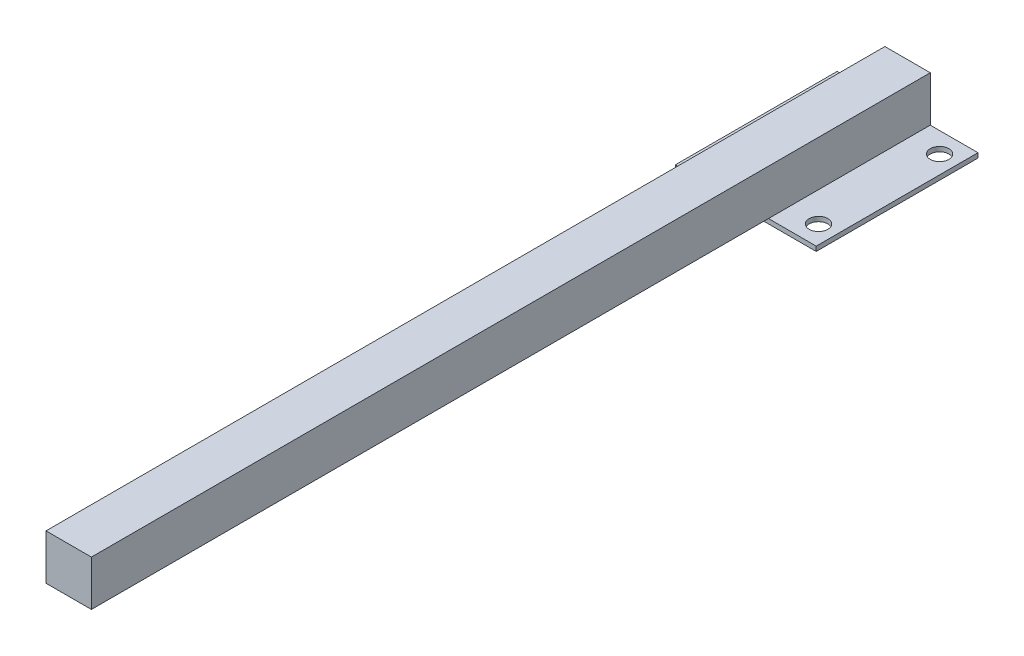
ISO-10303-21;
HEADER;
FILE_DESCRIPTION(('STEP AP214'),'2;1');
FILE_NAME('part.step','',(''),(''),'','','');
FILE_SCHEMA(('AUTOMOTIVE_DESIGN { 1 0 10303 214 1 1 1 1 }'));
ENDSEC;
DATA;
#1=APPLICATION_CONTEXT('core data for automotive mechanical design processes');
#2=APPLICATION_PROTOCOL_DEFINITION('international standard','automotive_design',2000,#1);
#3=PRODUCT_CONTEXT('',#1,'mechanical');
#4=PRODUCT('Part','Part','',(#3));
#5=PRODUCT_RELATED_PRODUCT_CATEGORY('part','',(#4));
#6=PRODUCT_DEFINITION_FORMATION('','',#4);
#7=PRODUCT_DEFINITION_CONTEXT('part definition',#1,'design');
#8=PRODUCT_DEFINITION('design','',#6,#7);
#9=PRODUCT_DEFINITION_SHAPE('','',#8);
#10=(LENGTH_UNIT() NAMED_UNIT(*) SI_UNIT(.MILLI.,.METRE.));
#11=(NAMED_UNIT(*) PLANE_ANGLE_UNIT() SI_UNIT($,.RADIAN.));
#12=(NAMED_UNIT(*) SI_UNIT($,.STERADIAN.) SOLID_ANGLE_UNIT());
#13=UNCERTAINTY_MEASURE_WITH_UNIT(LENGTH_MEASURE(1.E-05),#10,'distance_accuracy_value','');
#14=(GEOMETRIC_REPRESENTATION_CONTEXT(3) GLOBAL_UNCERTAINTY_ASSIGNED_CONTEXT((#13)) GLOBAL_UNIT_ASSIGNED_CONTEXT((#10,
#11,#12)) REPRESENTATION_CONTEXT('',''));
#15=CARTESIAN_POINT('',(0.,0.,0.));
#16=DIRECTION('',(0.,0.,1.));
#17=DIRECTION('',(1.,0.,0.));
#18=AXIS2_PLACEMENT_3D('',#15,#16,#17);
#19=CARTESIAN_POINT('',(0.,2.,0.));
#20=DIRECTION('',(0.,1.,0.));
#21=DIRECTION('',(0.,0.,1.));
#22=AXIS2_PLACEMENT_3D('',#19,#20,#21);
#23=PLANE('',#22);
#24=CARTESIAN_POINT('',(22.5,2.,26.));
#25=DIRECTION('',(0.,1.,0.));
#26=DIRECTION('',(0.,0.,1.));
#27=AXIS2_PLACEMENT_3D('',#24,#25,#26);
#28=CIRCLE('',#27,4.);
#29=CARTESIAN_POINT('',(22.5,2.,30.));
#30=VERTEX_POINT('',#29);
#31=EDGE_CURVE('E153',#30,#30,#28,.T.);
#32=ORIENTED_EDGE('',*,*,#31,.F.);
#33=EDGE_LOOP('',(#32));
#34=FACE_BOUND('',#33,.T.);
#35=CARTESIAN_POINT('',(22.5,2.,-26.));
#36=DIRECTION('',(0.,1.,0.));
#37=DIRECTION('',(0.,0.,-1.));
#38=AXIS2_PLACEMENT_3D('',#35,#36,#37);
#39=CIRCLE('',#38,4.);
#40=CARTESIAN_POINT('',(22.5,2.,-30.));
#41=VERTEX_POINT('',#40);
#42=EDGE_CURVE('E165',#41,#41,#39,.T.);
#43=ORIENTED_EDGE('',*,*,#42,.F.);
#44=EDGE_LOOP('',(#43));
#45=FACE_BOUND('',#44,.T.);
#46=DIRECTION('',(-1.,0.,0.));
#47=VECTOR('',#46,1.);
#48=CARTESIAN_POINT('',(-30.25,2.,-34.75));
#49=LINE('',#48,#47);
#50=CARTESIAN_POINT('',(30.25,2.,-34.75));
#51=VERTEX_POINT('',#50);
#52=CARTESIAN_POINT('',(9.75000000000001,2.,-34.75));
#53=VERTEX_POINT('',#52);
#54=EDGE_CURVE('E182',#51,#53,#49,.T.);
#55=ORIENTED_EDGE('',*,*,#54,.T.);
#56=DIRECTION('',(0.,0.,1.));
#57=VECTOR('',#56,1.);
#58=CARTESIAN_POINT('',(9.75,2.,-62.3271644662753));
#59=LINE('',#58,#57);
#60=CARTESIAN_POINT('',(9.75,2.,34.75));
#61=VERTEX_POINT('',#60);
#62=EDGE_CURVE('E56',#53,#61,#59,.T.);
#63=ORIENTED_EDGE('',*,*,#62,.T.);
#64=DIRECTION('',(1.,0.,0.));
#65=VECTOR('',#64,1.);
#66=CARTESIAN_POINT('',(-30.25,2.,34.75));
#67=LINE('',#66,#65);
#68=CARTESIAN_POINT('',(30.25,2.,34.75));
#69=VERTEX_POINT('',#68);
#70=EDGE_CURVE('E186',#61,#69,#67,.T.);
#71=ORIENTED_EDGE('',*,*,#70,.T.);
#72=DIRECTION('',(0.,0.,-1.));
#73=VECTOR('',#72,1.);
#74=CARTESIAN_POINT('',(30.25,2.,-34.75));
#75=LINE('',#74,#73);
#76=EDGE_CURVE('E177',#69,#51,#75,.T.);
#77=ORIENTED_EDGE('',*,*,#76,.T.);
#78=EDGE_LOOP('',(#55,#63,#71,#77));
#79=FACE_BOUND('',#78,.T.);
#80=ADVANCED_FACE('F41',(#34,#45,#79),#23,.T.);
#81=DIRECTION('',(0.,0.,1.));
#82=VECTOR('',#81,1.);
#83=CARTESIAN_POINT('',(-9.75,2.,-62.3271644662753));
#84=LINE('',#83,#82);
#85=CARTESIAN_POINT('',(-9.75,2.,-34.75));
#86=VERTEX_POINT('',#85);
#87=CARTESIAN_POINT('',(-9.75,2.,34.75));
#88=VERTEX_POINT('',#87);
#89=EDGE_CURVE('E64',#86,#88,#84,.T.);
#90=ORIENTED_EDGE('',*,*,#89,.F.);
#91=CARTESIAN_POINT('',(-30.25,2.,-34.75));
#92=VERTEX_POINT('',#91);
#93=EDGE_CURVE('E180',#86,#92,#49,.T.);
#94=ORIENTED_EDGE('',*,*,#93,.T.);
#95=DIRECTION('',(0.,0.,1.));
#96=VECTOR('',#95,1.);
#97=CARTESIAN_POINT('',(-30.25,2.,-34.75));
#98=LINE('',#97,#96);
#99=CARTESIAN_POINT('',(-30.25,2.,34.75));
#100=VERTEX_POINT('',#99);
#101=EDGE_CURVE('E184',#92,#100,#98,.T.);
#102=ORIENTED_EDGE('',*,*,#101,.T.);
#103=EDGE_CURVE('E187',#100,#88,#67,.T.);
#104=ORIENTED_EDGE('',*,*,#103,.T.);
#105=EDGE_LOOP('',(#90,#94,#102,#104));
#106=FACE_BOUND('',#105,.T.);
#107=CARTESIAN_POINT('',(-22.5,2.,26.));
#108=DIRECTION('',(0.,1.,0.));
#109=DIRECTION('',(0.,0.,-1.));
#110=AXIS2_PLACEMENT_3D('',#107,#108,#109);
#111=CIRCLE('',#110,4.);
#112=CARTESIAN_POINT('',(-22.5,2.,22.));
#113=VERTEX_POINT('',#112);
#114=EDGE_CURVE('E159',#113,#113,#111,.T.);
#115=ORIENTED_EDGE('',*,*,#114,.F.);
#116=EDGE_LOOP('',(#115));
#117=FACE_BOUND('',#116,.T.);
#118=CARTESIAN_POINT('',(-22.5,2.,-26.));
#119=DIRECTION('',(0.,1.,0.));
#120=DIRECTION('',(0.,0.,1.));
#121=AXIS2_PLACEMENT_3D('',#118,#119,#120);
#122=CIRCLE('',#121,4.);
#123=CARTESIAN_POINT('',(-22.5,2.,-22.));
#124=VERTEX_POINT('',#123);
#125=EDGE_CURVE('E171',#124,#124,#122,.T.);
#126=ORIENTED_EDGE('',*,*,#125,.F.);
#127=EDGE_LOOP('',(#126));
#128=FACE_BOUND('',#127,.T.);
#129=ADVANCED_FACE('F231',(#106,#117,#128),#23,.T.);
#130=CARTESIAN_POINT('',(0.,0.,0.));
#131=DIRECTION('',(0.,1.,0.));
#132=DIRECTION('',(0.,0.,1.));
#133=AXIS2_PLACEMENT_3D('',#130,#131,#132);
#134=PLANE('',#133);
#135=DIRECTION('',(0.,0.,-1.));
#136=VECTOR('',#135,1.);
#137=CARTESIAN_POINT('',(30.25,0.,-34.75));
#138=LINE('',#137,#136);
#139=CARTESIAN_POINT('',(30.25,0.,34.75));
#140=VERTEX_POINT('',#139);
#141=CARTESIAN_POINT('',(30.25,0.,-34.75));
#142=VERTEX_POINT('',#141);
#143=EDGE_CURVE('E174',#140,#142,#138,.T.);
#144=ORIENTED_EDGE('',*,*,#143,.F.);
#145=DIRECTION('',(1.,0.,0.));
#146=VECTOR('',#145,1.);
#147=CARTESIAN_POINT('',(-30.25,0.,34.75));
#148=LINE('',#147,#146);
#149=CARTESIAN_POINT('',(-30.25,0.,34.75));
#150=VERTEX_POINT('',#149);
#151=EDGE_CURVE('E181',#150,#140,#148,.T.);
#152=ORIENTED_EDGE('',*,*,#151,.F.);
#153=DIRECTION('',(0.,0.,1.));
#154=VECTOR('',#153,1.);
#155=CARTESIAN_POINT('',(-30.25,0.,-34.75));
#156=LINE('',#155,#154);
#157=CARTESIAN_POINT('',(-30.25,0.,-34.75));
#158=VERTEX_POINT('',#157);
#159=EDGE_CURVE('E195',#158,#150,#156,.T.);
#160=ORIENTED_EDGE('',*,*,#159,.F.);
#161=DIRECTION('',(-1.,0.,0.));
#162=VECTOR('',#161,1.);
#163=CARTESIAN_POINT('',(-30.25,0.,-34.75));
#164=LINE('',#163,#162);
#165=EDGE_CURVE('E193',#142,#158,#164,.T.);
#166=ORIENTED_EDGE('',*,*,#165,.F.);
#167=EDGE_LOOP('',(#144,#152,#160,#166));
#168=FACE_BOUND('',#167,.T.);
#169=CARTESIAN_POINT('',(-22.5,0.,-26.));
#170=DIRECTION('',(0.,1.,0.));
#171=DIRECTION('',(0.,0.,1.));
#172=AXIS2_PLACEMENT_3D('',#169,#170,#171);
#173=CIRCLE('',#172,4.);
#174=CARTESIAN_POINT('',(-22.5,0.,-22.));
#175=VERTEX_POINT('',#174);
#176=EDGE_CURVE('E168',#175,#175,#173,.T.);
#177=ORIENTED_EDGE('',*,*,#176,.T.);
#178=EDGE_LOOP('',(#177));
#179=FACE_BOUND('',#178,.T.);
#180=CARTESIAN_POINT('',(22.5,0.,-26.));
#181=DIRECTION('',(0.,1.,0.));
#182=DIRECTION('',(0.,0.,-1.));
#183=AXIS2_PLACEMENT_3D('',#180,#181,#182);
#184=CIRCLE('',#183,4.);
#185=CARTESIAN_POINT('',(22.5,0.,-30.));
#186=VERTEX_POINT('',#185);
#187=EDGE_CURVE('E162',#186,#186,#184,.T.);
#188=ORIENTED_EDGE('',*,*,#187,.T.);
#189=EDGE_LOOP('',(#188));
#190=FACE_BOUND('',#189,.T.);
#191=CARTESIAN_POINT('',(-22.5,0.,26.));
#192=DIRECTION('',(0.,1.,0.));
#193=DIRECTION('',(0.,0.,-1.));
#194=AXIS2_PLACEMENT_3D('',#191,#192,#193);
#195=CIRCLE('',#194,4.);
#196=CARTESIAN_POINT('',(-22.5,0.,22.));
#197=VERTEX_POINT('',#196);
#198=EDGE_CURVE('E156',#197,#197,#195,.T.);
#199=ORIENTED_EDGE('',*,*,#198,.T.);
#200=EDGE_LOOP('',(#199));
#201=FACE_BOUND('',#200,.T.);
#202=CARTESIAN_POINT('',(22.5,0.,26.));
#203=DIRECTION('',(0.,1.,0.));
#204=DIRECTION('',(0.,0.,1.));
#205=AXIS2_PLACEMENT_3D('',#202,#203,#204);
#206=CIRCLE('',#205,4.);
#207=CARTESIAN_POINT('',(22.5,0.,30.));
#208=VERTEX_POINT('',#207);
#209=EDGE_CURVE('E148',#208,#208,#206,.T.);
#210=ORIENTED_EDGE('',*,*,#209,.T.);
#211=EDGE_LOOP('',(#210));
#212=FACE_BOUND('',#211,.T.);
#213=ADVANCED_FACE('F213',(#168,#179,#190,#201,#212),#134,.F.);
#214=CARTESIAN_POINT('',(30.25,2.,-34.75));
#215=DIRECTION('',(-1.,0.,0.));
#216=DIRECTION('',(0.,0.,1.));
#217=AXIS2_PLACEMENT_3D('',#214,#215,#216);
#218=PLANE('',#217);
#219=ORIENTED_EDGE('',*,*,#143,.T.);
#220=DIRECTION('',(0.,-1.,0.));
#221=VECTOR('',#220,1.);
#222=CARTESIAN_POINT('',(30.25,2.,-34.75));
#223=LINE('',#222,#221);
#224=EDGE_CURVE('E11',#51,#142,#223,.T.);
#225=ORIENTED_EDGE('',*,*,#224,.F.);
#226=ORIENTED_EDGE('',*,*,#76,.F.);
#227=DIRECTION('',(0.,-1.,0.));
#228=VECTOR('',#227,1.);
#229=CARTESIAN_POINT('',(30.25,2.,34.75));
#230=LINE('',#229,#228);
#231=EDGE_CURVE('E189',#69,#140,#230,.T.);
#232=ORIENTED_EDGE('',*,*,#231,.T.);
#233=EDGE_LOOP('',(#219,#225,#226,#232));
#234=FACE_BOUND('',#233,.T.);
#235=ADVANCED_FACE('F43',(#234),#218,.F.);
#236=CARTESIAN_POINT('',(-30.25,2.,-34.75));
#237=DIRECTION('',(0.,0.,1.));
#238=DIRECTION('',(1.,0.,0.));
#239=AXIS2_PLACEMENT_3D('',#236,#237,#238);
#240=PLANE('',#239);
#241=ORIENTED_EDGE('',*,*,#165,.T.);
#242=DIRECTION('',(0.,-1.,0.));
#243=VECTOR('',#242,1.);
#244=CARTESIAN_POINT('',(-30.25,2.,-34.75));
#245=LINE('',#244,#243);
#246=EDGE_CURVE('E49',#92,#158,#245,.T.);
#247=ORIENTED_EDGE('',*,*,#246,.F.);
#248=ORIENTED_EDGE('',*,*,#93,.F.);
#249=DIRECTION('',(0.,1.,0.));
#250=VECTOR('',#249,1.);
#251=CARTESIAN_POINT('',(-9.75,2.,-34.75));
#252=LINE('',#251,#250);
#253=CARTESIAN_POINT('',(-9.75,21.5,-34.75));
#254=VERTEX_POINT('',#253);
#255=EDGE_CURVE('E146',#86,#254,#252,.T.);
#256=ORIENTED_EDGE('',*,*,#255,.T.);
#257=DIRECTION('',(1.,0.,0.));
#258=VECTOR('',#257,1.);
#259=CARTESIAN_POINT('',(-9.75,21.5,-34.75));
#260=LINE('',#259,#258);
#261=CARTESIAN_POINT('',(9.75,21.5,-34.75));
#262=VERTEX_POINT('',#261);
#263=EDGE_CURVE('E143',#254,#262,#260,.T.);
#264=ORIENTED_EDGE('',*,*,#263,.T.);
#265=DIRECTION('',(0.,-1.,0.));
#266=VECTOR('',#265,1.);
#267=CARTESIAN_POINT('',(9.75,2.,-34.75));
#268=LINE('',#267,#266);
#269=EDGE_CURVE('E140',#262,#53,#268,.T.);
#270=ORIENTED_EDGE('',*,*,#269,.T.);
#271=ORIENTED_EDGE('',*,*,#54,.F.);
#272=ORIENTED_EDGE('',*,*,#224,.T.);
#273=EDGE_LOOP('',(#241,#247,#248,#256,#264,#270,#271,#272));
#274=FACE_BOUND('',#273,.T.);
#275=ADVANCED_FACE('F230',(#274),#240,.F.);
#276=CARTESIAN_POINT('',(-30.25,2.,-34.75));
#277=DIRECTION('',(1.,0.,0.));
#278=DIRECTION('',(0.,0.,-1.));
#279=AXIS2_PLACEMENT_3D('',#276,#277,#278);
#280=PLANE('',#279);
#281=ORIENTED_EDGE('',*,*,#159,.T.);
#282=DIRECTION('',(0.,-1.,0.));
#283=VECTOR('',#282,1.);
#284=CARTESIAN_POINT('',(-30.25,2.,34.75));
#285=LINE('',#284,#283);
#286=EDGE_CURVE('E200',#100,#150,#285,.T.);
#287=ORIENTED_EDGE('',*,*,#286,.F.);
#288=ORIENTED_EDGE('',*,*,#101,.F.);
#289=ORIENTED_EDGE('',*,*,#246,.T.);
#290=EDGE_LOOP('',(#281,#287,#288,#289));
#291=FACE_BOUND('',#290,.T.);
#292=ADVANCED_FACE('F207',(#291),#280,.F.);
#293=CARTESIAN_POINT('',(-30.25,2.,34.75));
#294=DIRECTION('',(0.,0.,-1.));
#295=DIRECTION('',(-1.,0.,0.));
#296=AXIS2_PLACEMENT_3D('',#293,#294,#295);
#297=PLANE('',#296);
#298=ORIENTED_EDGE('',*,*,#151,.T.);
#299=ORIENTED_EDGE('',*,*,#231,.F.);
#300=ORIENTED_EDGE('',*,*,#70,.F.);
#301=EDGE_CURVE('E190',#88,#61,#67,.T.);
#302=ORIENTED_EDGE('',*,*,#301,.F.);
#303=ORIENTED_EDGE('',*,*,#103,.F.);
#304=ORIENTED_EDGE('',*,*,#286,.T.);
#305=EDGE_LOOP('',(#298,#299,#300,#302,#303,#304));
#306=FACE_BOUND('',#305,.T.);
#307=ADVANCED_FACE('F217',(#306),#297,.F.);
#308=CARTESIAN_POINT('',(-22.5,2.,-26.));
#309=DIRECTION('',(0.,-1.,0.));
#310=DIRECTION('',(0.,0.,-1.));
#311=AXIS2_PLACEMENT_3D('',#308,#309,#310);
#312=CYLINDRICAL_SURFACE('',#311,4.);
#313=ORIENTED_EDGE('',*,*,#125,.T.);
#314=EDGE_LOOP('',(#313));
#315=FACE_BOUND('',#314,.T.);
#316=ORIENTED_EDGE('',*,*,#176,.F.);
#317=EDGE_LOOP('',(#316));
#318=FACE_BOUND('',#317,.T.);
#319=ADVANCED_FACE('F239',(#315,#318),#312,.F.);
#320=CARTESIAN_POINT('',(22.5,2.,-26.));
#321=DIRECTION('',(0.,-1.,0.));
#322=DIRECTION('',(0.,0.,-1.));
#323=AXIS2_PLACEMENT_3D('',#320,#321,#322);
#324=CYLINDRICAL_SURFACE('',#323,4.);
#325=ORIENTED_EDGE('',*,*,#42,.T.);
#326=EDGE_LOOP('',(#325));
#327=FACE_BOUND('',#326,.T.);
#328=ORIENTED_EDGE('',*,*,#187,.F.);
#329=EDGE_LOOP('',(#328));
#330=FACE_BOUND('',#329,.T.);
#331=ADVANCED_FACE('F242',(#327,#330),#324,.F.);
#332=CARTESIAN_POINT('',(-22.5,2.,26.));
#333=DIRECTION('',(0.,-1.,0.));
#334=DIRECTION('',(0.,0.,-1.));
#335=AXIS2_PLACEMENT_3D('',#332,#333,#334);
#336=CYLINDRICAL_SURFACE('',#335,4.);
#337=ORIENTED_EDGE('',*,*,#114,.T.);
#338=EDGE_LOOP('',(#337));
#339=FACE_BOUND('',#338,.T.);
#340=ORIENTED_EDGE('',*,*,#198,.F.);
#341=EDGE_LOOP('',(#340));
#342=FACE_BOUND('',#341,.T.);
#343=ADVANCED_FACE('F256',(#339,#342),#336,.F.);
#344=CARTESIAN_POINT('',(22.5,2.,26.));
#345=DIRECTION('',(0.,-1.,0.));
#346=DIRECTION('',(0.,0.,-1.));
#347=AXIS2_PLACEMENT_3D('',#344,#345,#346);
#348=CYLINDRICAL_SURFACE('',#347,4.);
#349=ORIENTED_EDGE('',*,*,#31,.T.);
#350=EDGE_LOOP('',(#349));
#351=FACE_BOUND('',#350,.T.);
#352=ORIENTED_EDGE('',*,*,#209,.F.);
#353=EDGE_LOOP('',(#352));
#354=FACE_BOUND('',#353,.T.);
#355=ADVANCED_FACE('F254',(#351,#354),#348,.F.);
#356=CARTESIAN_POINT('',(-9.75,2.,-62.3271644662753));
#357=DIRECTION('',(-1.,0.,0.));
#358=DIRECTION('',(0.,0.,1.));
#359=AXIS2_PLACEMENT_3D('',#356,#357,#358);
#360=PLANE('',#359);
#361=ORIENTED_EDGE('',*,*,#255,.F.);
#362=ORIENTED_EDGE('',*,*,#89,.T.);
#363=CARTESIAN_POINT('',(-9.75,2.,325.596));
#364=VERTEX_POINT('',#363);
#365=EDGE_CURVE('E112',#88,#364,#84,.T.);
#366=ORIENTED_EDGE('',*,*,#365,.T.);
#367=DIRECTION('',(0.,-1.,0.));
#368=VECTOR('',#367,1.);
#369=CARTESIAN_POINT('',(-9.75,2.,325.596));
#370=LINE('',#369,#368);
#371=CARTESIAN_POINT('',(-9.75,21.5,325.596));
#372=VERTEX_POINT('',#371);
#373=EDGE_CURVE('E118',#372,#364,#370,.T.);
#374=ORIENTED_EDGE('',*,*,#373,.F.);
#375=DIRECTION('',(0.,0.,1.));
#376=VECTOR('',#375,1.);
#377=CARTESIAN_POINT('',(-9.75,21.5,-62.3271644662753));
#378=LINE('',#377,#376);
#379=EDGE_CURVE('E144',#254,#372,#378,.T.);
#380=ORIENTED_EDGE('',*,*,#379,.F.);
#381=EDGE_LOOP('',(#361,#362,#366,#374,#380));
#382=FACE_BOUND('',#381,.T.);
#383=ADVANCED_FACE('F115',(#382),#360,.T.);
#384=CARTESIAN_POINT('',(-9.75,21.5,-62.3271644662753));
#385=DIRECTION('',(0.,1.,0.));
#386=DIRECTION('',(0.,0.,1.));
#387=AXIS2_PLACEMENT_3D('',#384,#385,#386);
#388=PLANE('',#387);
#389=ORIENTED_EDGE('',*,*,#263,.F.);
#390=ORIENTED_EDGE('',*,*,#379,.T.);
#391=DIRECTION('',(-1.,0.,0.));
#392=VECTOR('',#391,1.);
#393=CARTESIAN_POINT('',(-9.75,21.5,325.596));
#394=LINE('',#393,#392);
#395=CARTESIAN_POINT('',(9.75,21.5,325.596));
#396=VERTEX_POINT('',#395);
#397=EDGE_CURVE('E121',#396,#372,#394,.T.);
#398=ORIENTED_EDGE('',*,*,#397,.F.);
#399=DIRECTION('',(0.,0.,1.));
#400=VECTOR('',#399,1.);
#401=CARTESIAN_POINT('',(9.75,21.5,-62.3271644662753));
#402=LINE('',#401,#400);
#403=EDGE_CURVE('E150',#262,#396,#402,.T.);
#404=ORIENTED_EDGE('',*,*,#403,.F.);
#405=EDGE_LOOP('',(#389,#390,#398,#404));
#406=FACE_BOUND('',#405,.T.);
#407=ADVANCED_FACE('F229',(#406),#388,.T.);
#408=CARTESIAN_POINT('',(9.75,2.,-62.3271644662753));
#409=DIRECTION('',(1.,0.,0.));
#410=DIRECTION('',(0.,0.,-1.));
#411=AXIS2_PLACEMENT_3D('',#408,#409,#410);
#412=PLANE('',#411);
#413=ORIENTED_EDGE('',*,*,#269,.F.);
#414=ORIENTED_EDGE('',*,*,#403,.T.);
#415=DIRECTION('',(0.,1.,0.));
#416=VECTOR('',#415,1.);
#417=CARTESIAN_POINT('',(9.75,2.,325.596));
#418=LINE('',#417,#416);
#419=CARTESIAN_POINT('',(9.75,2.,325.596));
#420=VERTEX_POINT('',#419);
#421=EDGE_CURVE('E131',#420,#396,#418,.T.);
#422=ORIENTED_EDGE('',*,*,#421,.F.);
#423=EDGE_CURVE('E127',#61,#420,#59,.T.);
#424=ORIENTED_EDGE('',*,*,#423,.F.);
#425=ORIENTED_EDGE('',*,*,#62,.F.);
#426=EDGE_LOOP('',(#413,#414,#422,#424,#425));
#427=FACE_BOUND('',#426,.T.);
#428=ADVANCED_FACE('F225',(#427),#412,.T.);
#429=CARTESIAN_POINT('',(-9.75,2.,-62.3271644662753));
#430=DIRECTION('',(0.,-1.,0.));
#431=DIRECTION('',(0.,0.,-1.));
#432=AXIS2_PLACEMENT_3D('',#429,#430,#431);
#433=PLANE('',#432);
#434=ORIENTED_EDGE('',*,*,#365,.F.);
#435=ORIENTED_EDGE('',*,*,#301,.T.);
#436=ORIENTED_EDGE('',*,*,#423,.T.);
#437=DIRECTION('',(1.,0.,0.));
#438=VECTOR('',#437,1.);
#439=CARTESIAN_POINT('',(-9.75,2.,325.596));
#440=LINE('',#439,#438);
#441=EDGE_CURVE('E124',#364,#420,#440,.T.);
#442=ORIENTED_EDGE('',*,*,#441,.F.);
#443=EDGE_LOOP('',(#434,#435,#436,#442));
#444=FACE_BOUND('',#443,.T.);
#445=ADVANCED_FACE('F125',(#444),#433,.T.);
#446=CARTESIAN_POINT('',(0.,0.,325.596));
#447=DIRECTION('',(0.,0.,-1.));
#448=DIRECTION('',(-1.,0.,0.));
#449=AXIS2_PLACEMENT_3D('',#446,#447,#448);
#450=PLANE('',#449);
#451=ORIENTED_EDGE('',*,*,#373,.T.);
#452=ORIENTED_EDGE('',*,*,#441,.T.);
#453=ORIENTED_EDGE('',*,*,#421,.T.);
#454=ORIENTED_EDGE('',*,*,#397,.T.);
#455=EDGE_LOOP('',(#451,#452,#453,#454));
#456=FACE_BOUND('',#455,.T.);
#457=ADVANCED_FACE('F134',(#456),#450,.F.);
#458=CLOSED_SHELL('',(#80,#129,#213,#235,#275,#292,#307,#319,#331,#343,#355,#383,#407,#428,#445,#457));
#459=MANIFOLD_SOLID_BREP('B2',#458);
#460=ADVANCED_BREP_SHAPE_REPRESENTATION('',(#18,#459),#14);
#461=SHAPE_DEFINITION_REPRESENTATION(#9,#460);
ENDSEC;
END-ISO-10303-21;
